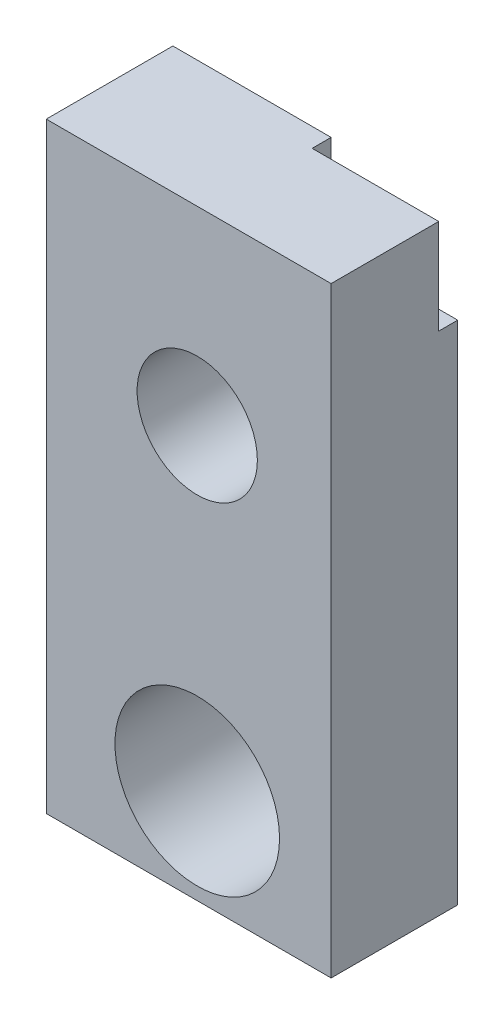
ISO-10303-21;
HEADER;
FILE_DESCRIPTION(('STEP AP214'),'2;1');
FILE_NAME('part.step','',(''),(''),'','','');
FILE_SCHEMA(('AUTOMOTIVE_DESIGN { 1 0 10303 214 1 1 1 1 }'));
ENDSEC;
DATA;
#1=APPLICATION_CONTEXT('core data for automotive mechanical design processes');
#2=APPLICATION_PROTOCOL_DEFINITION('international standard','automotive_design',2000,#1);
#3=PRODUCT_CONTEXT('',#1,'mechanical');
#4=PRODUCT('Part','Part','',(#3));
#5=PRODUCT_RELATED_PRODUCT_CATEGORY('part','',(#4));
#6=PRODUCT_DEFINITION_FORMATION('','',#4);
#7=PRODUCT_DEFINITION_CONTEXT('part definition',#1,'design');
#8=PRODUCT_DEFINITION('design','',#6,#7);
#9=PRODUCT_DEFINITION_SHAPE('','',#8);
#10=(LENGTH_UNIT() NAMED_UNIT(*) SI_UNIT(.MILLI.,.METRE.));
#11=(NAMED_UNIT(*) PLANE_ANGLE_UNIT() SI_UNIT($,.RADIAN.));
#12=(NAMED_UNIT(*) SI_UNIT($,.STERADIAN.) SOLID_ANGLE_UNIT());
#13=UNCERTAINTY_MEASURE_WITH_UNIT(LENGTH_MEASURE(1.E-05),#10,'distance_accuracy_value','');
#14=(GEOMETRIC_REPRESENTATION_CONTEXT(3) GLOBAL_UNCERTAINTY_ASSIGNED_CONTEXT((#13)) GLOBAL_UNIT_ASSIGNED_CONTEXT((#10,
#11,#12)) REPRESENTATION_CONTEXT('',''));
#15=CARTESIAN_POINT('',(0.,0.,0.));
#16=DIRECTION('',(0.,0.,1.));
#17=DIRECTION('',(1.,0.,0.));
#18=AXIS2_PLACEMENT_3D('',#15,#16,#17);
#19=CARTESIAN_POINT('',(0.,0.,20.));
#20=DIRECTION('',(0.,1.,0.));
#21=DIRECTION('',(0.,0.,1.));
#22=AXIS2_PLACEMENT_3D('',#19,#20,#21);
#23=PLANE('',#22);
#24=DIRECTION('',(1.,0.,0.));
#25=VECTOR('',#24,1.);
#26=CARTESIAN_POINT('',(0.,0.,0.));
#27=LINE('',#26,#25);
#28=CARTESIAN_POINT('',(-2.,0.,0.));
#29=VERTEX_POINT('',#28);
#30=CARTESIAN_POINT('',(43.,0.,0.));
#31=VERTEX_POINT('',#30);
#32=EDGE_CURVE('E71',#29,#31,#27,.T.);
#33=ORIENTED_EDGE('',*,*,#32,.T.);
#34=DIRECTION('',(0.,0.,-1.));
#35=VECTOR('',#34,1.);
#36=CARTESIAN_POINT('',(43.,0.,20.));
#37=LINE('',#36,#35);
#38=CARTESIAN_POINT('',(43.,0.,20.));
#39=VERTEX_POINT('',#38);
#40=EDGE_CURVE('E11',#39,#31,#37,.T.);
#41=ORIENTED_EDGE('',*,*,#40,.F.);
#42=DIRECTION('',(1.,0.,0.));
#43=VECTOR('',#42,1.);
#44=CARTESIAN_POINT('',(0.,0.,20.));
#45=LINE('',#44,#43);
#46=CARTESIAN_POINT('',(-2.,0.,20.));
#47=VERTEX_POINT('',#46);
#48=EDGE_CURVE('E122',#47,#39,#45,.T.);
#49=ORIENTED_EDGE('',*,*,#48,.F.);
#50=DIRECTION('',(0.,0.,1.));
#51=VECTOR('',#50,1.);
#52=CARTESIAN_POINT('',(-2.,0.,0.));
#53=LINE('',#52,#51);
#54=EDGE_CURVE('E121',#29,#47,#53,.T.);
#55=ORIENTED_EDGE('',*,*,#54,.F.);
#56=EDGE_LOOP('',(#33,#41,#49,#55));
#57=FACE_BOUND('',#56,.T.);
#58=ADVANCED_FACE('F35',(#57),#23,.F.);
#59=CARTESIAN_POINT('',(43.,0.,20.));
#60=DIRECTION('',(-1.,0.,0.));
#61=DIRECTION('',(0.,-1.,0.));
#62=AXIS2_PLACEMENT_3D('',#59,#60,#61);
#63=PLANE('',#62);
#64=DIRECTION('',(0.,0.,-1.));
#65=VECTOR('',#64,1.);
#66=CARTESIAN_POINT('',(43.,80.,0.));
#67=LINE('',#66,#65);
#68=CARTESIAN_POINT('',(43.,80.,3.));
#69=VERTEX_POINT('',#68);
#70=CARTESIAN_POINT('',(43.,80.,0.));
#71=VERTEX_POINT('',#70);
#72=EDGE_CURVE('E51',#69,#71,#67,.T.);
#73=ORIENTED_EDGE('',*,*,#72,.F.);
#74=DIRECTION('',(0.,1.,0.));
#75=VECTOR('',#74,1.);
#76=CARTESIAN_POINT('',(43.,80.,3.));
#77=LINE('',#76,#75);
#78=CARTESIAN_POINT('',(43.,95.,3.));
#79=VERTEX_POINT('',#78);
#80=EDGE_CURVE('E79',#69,#79,#77,.T.);
#81=ORIENTED_EDGE('',*,*,#80,.T.);
#82=DIRECTION('',(0.,0.,-1.));
#83=VECTOR('',#82,1.);
#84=CARTESIAN_POINT('',(43.,95.,20.));
#85=LINE('',#84,#83);
#86=CARTESIAN_POINT('',(43.,95.,20.));
#87=VERTEX_POINT('',#86);
#88=EDGE_CURVE('E43',#87,#79,#85,.T.);
#89=ORIENTED_EDGE('',*,*,#88,.F.);
#90=DIRECTION('',(0.,1.,0.));
#91=VECTOR('',#90,1.);
#92=CARTESIAN_POINT('',(43.,0.,20.));
#93=LINE('',#92,#91);
#94=EDGE_CURVE('E60',#39,#87,#93,.T.);
#95=ORIENTED_EDGE('',*,*,#94,.F.);
#96=ORIENTED_EDGE('',*,*,#40,.T.);
#97=DIRECTION('',(0.,1.,0.));
#98=VECTOR('',#97,1.);
#99=CARTESIAN_POINT('',(43.,0.,0.));
#100=LINE('',#99,#98);
#101=EDGE_CURVE('E117',#31,#71,#100,.T.);
#102=ORIENTED_EDGE('',*,*,#101,.T.);
#103=EDGE_LOOP('',(#73,#81,#89,#95,#96,#102));
#104=FACE_BOUND('',#103,.T.);
#105=ADVANCED_FACE('F213',(#104),#63,.F.);
#106=CARTESIAN_POINT('',(0.,95.,20.));
#107=DIRECTION('',(0.,-1.,0.));
#108=DIRECTION('',(0.,0.,-1.));
#109=AXIS2_PLACEMENT_3D('',#106,#107,#108);
#110=PLANE('',#109);
#111=ORIENTED_EDGE('',*,*,#88,.T.);
#112=DIRECTION('',(1.,0.,0.));
#113=VECTOR('',#112,1.);
#114=CARTESIAN_POINT('',(43.,95.,3.));
#115=LINE('',#114,#113);
#116=CARTESIAN_POINT('',(23.,95.,3.));
#117=VERTEX_POINT('',#116);
#118=EDGE_CURVE('E93',#117,#79,#115,.T.);
#119=ORIENTED_EDGE('',*,*,#118,.F.);
#120=DIRECTION('',(0.,0.,1.));
#121=VECTOR('',#120,1.);
#122=CARTESIAN_POINT('',(23.,95.,0.));
#123=LINE('',#122,#121);
#124=CARTESIAN_POINT('',(23.,95.,0.));
#125=VERTEX_POINT('',#124);
#126=EDGE_CURVE('E158',#125,#117,#123,.T.);
#127=ORIENTED_EDGE('',*,*,#126,.F.);
#128=DIRECTION('',(-1.,0.,0.));
#129=VECTOR('',#128,1.);
#130=CARTESIAN_POINT('',(0.,95.,0.));
#131=LINE('',#130,#129);
#132=CARTESIAN_POINT('',(-2.00000000000003,95.,0.));
#133=VERTEX_POINT('',#132);
#134=EDGE_CURVE('E182',#125,#133,#131,.T.);
#135=ORIENTED_EDGE('',*,*,#134,.T.);
#136=DIRECTION('',(0.,0.,-1.));
#137=VECTOR('',#136,1.);
#138=CARTESIAN_POINT('',(-2.00000000000003,95.,0.));
#139=LINE('',#138,#137);
#140=CARTESIAN_POINT('',(-2.00000000000003,95.,20.));
#141=VERTEX_POINT('',#140);
#142=EDGE_CURVE('E131',#141,#133,#139,.T.);
#143=ORIENTED_EDGE('',*,*,#142,.F.);
#144=DIRECTION('',(-1.,0.,0.));
#145=VECTOR('',#144,1.);
#146=CARTESIAN_POINT('',(0.,95.,20.));
#147=LINE('',#146,#145);
#148=EDGE_CURVE('E184',#87,#141,#147,.T.);
#149=ORIENTED_EDGE('',*,*,#148,.F.);
#150=EDGE_LOOP('',(#111,#119,#127,#135,#143,#149));
#151=FACE_BOUND('',#150,.T.);
#152=ADVANCED_FACE('F206',(#151),#110,.F.);
#153=CARTESIAN_POINT('',(0.,0.,20.));
#154=DIRECTION('',(0.,0.,-1.));
#155=DIRECTION('',(-1.,0.,0.));
#156=AXIS2_PLACEMENT_3D('',#153,#154,#155);
#157=PLANE('',#156);
#158=CARTESIAN_POINT('',(21.85,65.,20.));
#159=DIRECTION('',(0.,0.,1.));
#160=DIRECTION('',(1.,0.,0.));
#161=AXIS2_PLACEMENT_3D('',#158,#159,#160);
#162=CIRCLE('',#161,9.5);
#163=CARTESIAN_POINT('',(31.35,65.,20.));
#164=VERTEX_POINT('',#163);
#165=EDGE_CURVE('E172',#164,#164,#162,.T.);
#166=ORIENTED_EDGE('',*,*,#165,.F.);
#167=EDGE_LOOP('',(#166));
#168=FACE_BOUND('',#167,.T.);
#169=CARTESIAN_POINT('',(21.85,15.,20.));
#170=DIRECTION('',(0.,0.,1.));
#171=DIRECTION('',(1.,0.,0.));
#172=AXIS2_PLACEMENT_3D('',#169,#170,#171);
#173=CIRCLE('',#172,13.);
#174=CARTESIAN_POINT('',(34.85,15.,20.));
#175=VERTEX_POINT('',#174);
#176=EDGE_CURVE('E178',#175,#175,#173,.T.);
#177=ORIENTED_EDGE('',*,*,#176,.F.);
#178=EDGE_LOOP('',(#177));
#179=FACE_BOUND('',#178,.T.);
#180=ORIENTED_EDGE('',*,*,#148,.T.);
#181=DIRECTION('',(0.,1.,0.));
#182=VECTOR('',#181,1.);
#183=CARTESIAN_POINT('',(-2.,0.,20.));
#184=LINE('',#183,#182);
#185=EDGE_CURVE('E126',#47,#141,#184,.T.);
#186=ORIENTED_EDGE('',*,*,#185,.F.);
#187=ORIENTED_EDGE('',*,*,#48,.T.);
#188=ORIENTED_EDGE('',*,*,#94,.T.);
#189=EDGE_LOOP('',(#180,#186,#187,#188));
#190=FACE_BOUND('',#189,.T.);
#191=ADVANCED_FACE('F196',(#168,#179,#190),#157,.F.);
#192=CARTESIAN_POINT('',(0.,0.,0.));
#193=DIRECTION('',(0.,0.,-1.));
#194=DIRECTION('',(-1.,0.,0.));
#195=AXIS2_PLACEMENT_3D('',#192,#193,#194);
#196=PLANE('',#195);
#197=CARTESIAN_POINT('',(39.35,15.,0.));
#198=DIRECTION('',(0.,0.,-1.));
#199=DIRECTION('',(-1.,0.,0.));
#200=AXIS2_PLACEMENT_3D('',#197,#198,#199);
#201=CIRCLE('',#200,1.5);
#202=CARTESIAN_POINT('',(37.85,15.,0.));
#203=VERTEX_POINT('',#202);
#204=EDGE_CURVE('E136',#203,#203,#201,.T.);
#205=ORIENTED_EDGE('',*,*,#204,.F.);
#206=EDGE_LOOP('',(#205));
#207=FACE_BOUND('',#206,.T.);
#208=CARTESIAN_POINT('',(4.34999999999997,15.,0.));
#209=DIRECTION('',(0.,0.,-1.));
#210=DIRECTION('',(-1.,0.,0.));
#211=AXIS2_PLACEMENT_3D('',#208,#209,#210);
#212=CIRCLE('',#211,1.5);
#213=CARTESIAN_POINT('',(2.84999999999997,15.,0.));
#214=VERTEX_POINT('',#213);
#215=EDGE_CURVE('E140',#214,#214,#212,.T.);
#216=ORIENTED_EDGE('',*,*,#215,.F.);
#217=EDGE_LOOP('',(#216));
#218=FACE_BOUND('',#217,.T.);
#219=DIRECTION('',(0.,1.,0.));
#220=VECTOR('',#219,1.);
#221=CARTESIAN_POINT('',(23.,80.,0.));
#222=LINE('',#221,#220);
#223=CARTESIAN_POINT('',(23.,80.,0.));
#224=VERTEX_POINT('',#223);
#225=EDGE_CURVE('E167',#224,#125,#222,.T.);
#226=ORIENTED_EDGE('',*,*,#225,.F.);
#227=DIRECTION('',(-1.,0.,0.));
#228=VECTOR('',#227,1.);
#229=CARTESIAN_POINT('',(43.,80.,0.));
#230=LINE('',#229,#228);
#231=EDGE_CURVE('E162',#71,#224,#230,.T.);
#232=ORIENTED_EDGE('',*,*,#231,.F.);
#233=ORIENTED_EDGE('',*,*,#101,.F.);
#234=ORIENTED_EDGE('',*,*,#32,.F.);
#235=DIRECTION('',(0.,-1.,0.));
#236=VECTOR('',#235,1.);
#237=CARTESIAN_POINT('',(-2.,0.,0.));
#238=LINE('',#237,#236);
#239=EDGE_CURVE('E115',#133,#29,#238,.T.);
#240=ORIENTED_EDGE('',*,*,#239,.F.);
#241=ORIENTED_EDGE('',*,*,#134,.F.);
#242=EDGE_LOOP('',(#226,#232,#233,#234,#240,#241));
#243=FACE_BOUND('',#242,.T.);
#244=CARTESIAN_POINT('',(21.85,65.,0.));
#245=DIRECTION('',(0.,0.,-1.));
#246=DIRECTION('',(-1.,0.,0.));
#247=AXIS2_PLACEMENT_3D('',#244,#245,#246);
#248=CIRCLE('',#247,9.5);
#249=CARTESIAN_POINT('',(12.35,65.,0.));
#250=VERTEX_POINT('',#249);
#251=EDGE_CURVE('E38',#250,#250,#248,.T.);
#252=ORIENTED_EDGE('',*,*,#251,.F.);
#253=EDGE_LOOP('',(#252));
#254=FACE_BOUND('',#253,.T.);
#255=CARTESIAN_POINT('',(21.85,15.,0.));
#256=DIRECTION('',(0.,0.,-1.));
#257=DIRECTION('',(-1.,0.,0.));
#258=AXIS2_PLACEMENT_3D('',#255,#256,#257);
#259=CIRCLE('',#258,13.);
#260=CARTESIAN_POINT('',(8.85,15.,0.));
#261=VERTEX_POINT('',#260);
#262=EDGE_CURVE('E118',#261,#261,#259,.T.);
#263=ORIENTED_EDGE('',*,*,#262,.F.);
#264=EDGE_LOOP('',(#263));
#265=FACE_BOUND('',#264,.T.);
#266=ADVANCED_FACE('F111',(#207,#218,#243,#254,#265),#196,.T.);
#267=CARTESIAN_POINT('',(21.85,15.,-14.));
#268=DIRECTION('',(0.,0.,1.));
#269=DIRECTION('',(1.,0.,0.));
#270=AXIS2_PLACEMENT_3D('',#267,#268,#269);
#271=CYLINDRICAL_SURFACE('',#270,13.);
#272=ORIENTED_EDGE('',*,*,#262,.T.);
#273=EDGE_LOOP('',(#272));
#274=FACE_BOUND('',#273,.T.);
#275=ORIENTED_EDGE('',*,*,#176,.T.);
#276=EDGE_LOOP('',(#275));
#277=FACE_BOUND('',#276,.T.);
#278=ADVANCED_FACE('F192',(#274,#277),#271,.F.);
#279=CARTESIAN_POINT('',(21.85,65.,-14.));
#280=DIRECTION('',(0.,0.,1.));
#281=DIRECTION('',(1.,0.,0.));
#282=AXIS2_PLACEMENT_3D('',#279,#280,#281);
#283=CYLINDRICAL_SURFACE('',#282,9.5);
#284=ORIENTED_EDGE('',*,*,#251,.T.);
#285=EDGE_LOOP('',(#284));
#286=FACE_BOUND('',#285,.T.);
#287=ORIENTED_EDGE('',*,*,#165,.T.);
#288=EDGE_LOOP('',(#287));
#289=FACE_BOUND('',#288,.T.);
#290=ADVANCED_FACE('F204',(#286,#289),#283,.F.);
#291=CARTESIAN_POINT('',(43.,80.,3.));
#292=DIRECTION('',(0.,0.,1.));
#293=DIRECTION('',(1.,0.,0.));
#294=AXIS2_PLACEMENT_3D('',#291,#292,#293);
#295=PLANE('',#294);
#296=CARTESIAN_POINT('',(28.,86.,3.));
#297=DIRECTION('',(0.,0.,-1.));
#298=DIRECTION('',(-1.,0.,0.));
#299=AXIS2_PLACEMENT_3D('',#296,#297,#298);
#300=CIRCLE('',#299,1.62);
#301=CARTESIAN_POINT('',(26.38,86.,3.));
#302=VERTEX_POINT('',#301);
#303=EDGE_CURVE('E146',#302,#302,#300,.T.);
#304=ORIENTED_EDGE('',*,*,#303,.F.);
#305=EDGE_LOOP('',(#304));
#306=FACE_BOUND('',#305,.T.);
#307=CARTESIAN_POINT('',(38.,86.,3.));
#308=DIRECTION('',(0.,0.,-1.));
#309=DIRECTION('',(-1.,0.,0.));
#310=AXIS2_PLACEMENT_3D('',#307,#308,#309);
#311=CIRCLE('',#310,1.62);
#312=CARTESIAN_POINT('',(36.38,86.,3.));
#313=VERTEX_POINT('',#312);
#314=EDGE_CURVE('E152',#313,#313,#311,.T.);
#315=ORIENTED_EDGE('',*,*,#314,.F.);
#316=EDGE_LOOP('',(#315));
#317=FACE_BOUND('',#316,.T.);
#318=ORIENTED_EDGE('',*,*,#118,.T.);
#319=ORIENTED_EDGE('',*,*,#80,.F.);
#320=DIRECTION('',(1.,0.,0.));
#321=VECTOR('',#320,1.);
#322=CARTESIAN_POINT('',(43.,80.,3.));
#323=LINE('',#322,#321);
#324=CARTESIAN_POINT('',(23.,80.,3.));
#325=VERTEX_POINT('',#324);
#326=EDGE_CURVE('E165',#325,#69,#323,.T.);
#327=ORIENTED_EDGE('',*,*,#326,.F.);
#328=DIRECTION('',(0.,1.,0.));
#329=VECTOR('',#328,1.);
#330=CARTESIAN_POINT('',(23.,80.,3.));
#331=LINE('',#330,#329);
#332=EDGE_CURVE('E173',#325,#117,#331,.T.);
#333=ORIENTED_EDGE('',*,*,#332,.T.);
#334=EDGE_LOOP('',(#318,#319,#327,#333));
#335=FACE_BOUND('',#334,.T.);
#336=ADVANCED_FACE('F227',(#306,#317,#335),#295,.F.);
#337=CARTESIAN_POINT('',(23.,80.,0.));
#338=DIRECTION('',(-1.,0.,0.));
#339=DIRECTION('',(0.,0.,1.));
#340=AXIS2_PLACEMENT_3D('',#337,#338,#339);
#341=PLANE('',#340);
#342=ORIENTED_EDGE('',*,*,#126,.T.);
#343=ORIENTED_EDGE('',*,*,#332,.F.);
#344=DIRECTION('',(0.,0.,1.));
#345=VECTOR('',#344,1.);
#346=CARTESIAN_POINT('',(23.,80.,0.));
#347=LINE('',#346,#345);
#348=EDGE_CURVE('E97',#224,#325,#347,.T.);
#349=ORIENTED_EDGE('',*,*,#348,.F.);
#350=ORIENTED_EDGE('',*,*,#225,.T.);
#351=EDGE_LOOP('',(#342,#343,#349,#350));
#352=FACE_BOUND('',#351,.T.);
#353=ADVANCED_FACE('F225',(#352),#341,.F.);
#354=CARTESIAN_POINT('',(0.,80.,0.));
#355=DIRECTION('',(0.,-1.,0.));
#356=DIRECTION('',(0.,0.,-1.));
#357=AXIS2_PLACEMENT_3D('',#354,#355,#356);
#358=PLANE('',#357);
#359=ORIENTED_EDGE('',*,*,#72,.T.);
#360=ORIENTED_EDGE('',*,*,#231,.T.);
#361=ORIENTED_EDGE('',*,*,#348,.T.);
#362=ORIENTED_EDGE('',*,*,#326,.T.);
#363=EDGE_LOOP('',(#359,#360,#361,#362));
#364=FACE_BOUND('',#363,.T.);
#365=ADVANCED_FACE('F226',(#364),#358,.F.);
#366=CARTESIAN_POINT('',(38.,86.,8.));
#367=DIRECTION('',(0.,0.,-1.));
#368=DIRECTION('',(-1.,0.,0.));
#369=AXIS2_PLACEMENT_3D('',#366,#367,#368);
#370=CYLINDRICAL_SURFACE('',#369,1.62);
#371=CARTESIAN_POINT('',(38.,86.,8.));
#372=DIRECTION('',(0.,0.,-1.));
#373=DIRECTION('',(-1.,0.,0.));
#374=AXIS2_PLACEMENT_3D('',#371,#372,#373);
#375=CIRCLE('',#374,1.62);
#376=CARTESIAN_POINT('',(36.38,86.,8.));
#377=VERTEX_POINT('',#376);
#378=EDGE_CURVE('E155',#377,#377,#375,.T.);
#379=ORIENTED_EDGE('',*,*,#378,.F.);
#380=EDGE_LOOP('',(#379));
#381=FACE_BOUND('',#380,.T.);
#382=ORIENTED_EDGE('',*,*,#314,.T.);
#383=EDGE_LOOP('',(#382));
#384=FACE_BOUND('',#383,.T.);
#385=ADVANCED_FACE('F243',(#381,#384),#370,.F.);
#386=CARTESIAN_POINT('',(38.,86.,8.));
#387=DIRECTION('',(0.,0.,-1.));
#388=DIRECTION('',(-1.,0.,0.));
#389=AXIS2_PLACEMENT_3D('',#386,#387,#388);
#390=PLANE('',#389);
#391=ORIENTED_EDGE('',*,*,#378,.T.);
#392=EDGE_LOOP('',(#391));
#393=FACE_BOUND('',#392,.T.);
#394=ADVANCED_FACE('F246',(#393),#390,.T.);
#395=CARTESIAN_POINT('',(28.,86.,8.));
#396=DIRECTION('',(0.,0.,-1.));
#397=DIRECTION('',(-1.,0.,0.));
#398=AXIS2_PLACEMENT_3D('',#395,#396,#397);
#399=CYLINDRICAL_SURFACE('',#398,1.62);
#400=CARTESIAN_POINT('',(28.,86.,8.));
#401=DIRECTION('',(0.,0.,-1.));
#402=DIRECTION('',(-1.,0.,0.));
#403=AXIS2_PLACEMENT_3D('',#400,#401,#402);
#404=CIRCLE('',#403,1.62);
#405=CARTESIAN_POINT('',(26.38,86.,8.));
#406=VERTEX_POINT('',#405);
#407=EDGE_CURVE('E149',#406,#406,#404,.T.);
#408=ORIENTED_EDGE('',*,*,#407,.F.);
#409=EDGE_LOOP('',(#408));
#410=FACE_BOUND('',#409,.T.);
#411=ORIENTED_EDGE('',*,*,#303,.T.);
#412=EDGE_LOOP('',(#411));
#413=FACE_BOUND('',#412,.T.);
#414=ADVANCED_FACE('F250',(#410,#413),#399,.F.);
#415=CARTESIAN_POINT('',(28.,86.,8.));
#416=DIRECTION('',(0.,0.,-1.));
#417=DIRECTION('',(-1.,0.,0.));
#418=AXIS2_PLACEMENT_3D('',#415,#416,#417);
#419=PLANE('',#418);
#420=ORIENTED_EDGE('',*,*,#407,.T.);
#421=EDGE_LOOP('',(#420));
#422=FACE_BOUND('',#421,.T.);
#423=ADVANCED_FACE('F254',(#422),#419,.T.);
#424=CARTESIAN_POINT('',(4.34999999999997,15.,12.));
#425=DIRECTION('',(0.,0.,-1.));
#426=DIRECTION('',(-1.,0.,0.));
#427=AXIS2_PLACEMENT_3D('',#424,#425,#426);
#428=CYLINDRICAL_SURFACE('',#427,1.5);
#429=CARTESIAN_POINT('',(4.34999999999997,15.,12.));
#430=DIRECTION('',(0.,0.,-1.));
#431=DIRECTION('',(-1.,0.,0.));
#432=AXIS2_PLACEMENT_3D('',#429,#430,#431);
#433=CIRCLE('',#432,1.5);
#434=CARTESIAN_POINT('',(2.84999999999997,15.,12.));
#435=VERTEX_POINT('',#434);
#436=EDGE_CURVE('E143',#435,#435,#433,.T.);
#437=ORIENTED_EDGE('',*,*,#436,.F.);
#438=EDGE_LOOP('',(#437));
#439=FACE_BOUND('',#438,.T.);
#440=ORIENTED_EDGE('',*,*,#215,.T.);
#441=EDGE_LOOP('',(#440));
#442=FACE_BOUND('',#441,.T.);
#443=ADVANCED_FACE('F258',(#439,#442),#428,.F.);
#444=CARTESIAN_POINT('',(4.34999999999997,15.,12.));
#445=DIRECTION('',(0.,0.,-1.));
#446=DIRECTION('',(-1.,0.,0.));
#447=AXIS2_PLACEMENT_3D('',#444,#445,#446);
#448=PLANE('',#447);
#449=ORIENTED_EDGE('',*,*,#436,.T.);
#450=EDGE_LOOP('',(#449));
#451=FACE_BOUND('',#450,.T.);
#452=ADVANCED_FACE('F262',(#451),#448,.T.);
#453=CARTESIAN_POINT('',(39.35,15.,12.));
#454=DIRECTION('',(0.,0.,-1.));
#455=DIRECTION('',(-1.,0.,0.));
#456=AXIS2_PLACEMENT_3D('',#453,#454,#455);
#457=CYLINDRICAL_SURFACE('',#456,1.5);
#458=CARTESIAN_POINT('',(39.35,15.,12.));
#459=DIRECTION('',(0.,0.,-1.));
#460=DIRECTION('',(-1.,0.,0.));
#461=AXIS2_PLACEMENT_3D('',#458,#459,#460);
#462=CIRCLE('',#461,1.5);
#463=CARTESIAN_POINT('',(37.85,15.,12.));
#464=VERTEX_POINT('',#463);
#465=EDGE_CURVE('E137',#464,#464,#462,.T.);
#466=ORIENTED_EDGE('',*,*,#465,.F.);
#467=EDGE_LOOP('',(#466));
#468=FACE_BOUND('',#467,.T.);
#469=ORIENTED_EDGE('',*,*,#204,.T.);
#470=EDGE_LOOP('',(#469));
#471=FACE_BOUND('',#470,.T.);
#472=ADVANCED_FACE('F266',(#468,#471),#457,.F.);
#473=CARTESIAN_POINT('',(39.35,15.,12.));
#474=DIRECTION('',(0.,0.,-1.));
#475=DIRECTION('',(-1.,0.,0.));
#476=AXIS2_PLACEMENT_3D('',#473,#474,#475);
#477=PLANE('',#476);
#478=ORIENTED_EDGE('',*,*,#465,.T.);
#479=EDGE_LOOP('',(#478));
#480=FACE_BOUND('',#479,.T.);
#481=ADVANCED_FACE('F270',(#480),#477,.T.);
#482=CARTESIAN_POINT('',(-2.,0.,0.));
#483=DIRECTION('',(1.,0.,0.));
#484=DIRECTION('',(0.,1.,0.));
#485=AXIS2_PLACEMENT_3D('',#482,#483,#484);
#486=PLANE('',#485);
#487=ORIENTED_EDGE('',*,*,#239,.T.);
#488=ORIENTED_EDGE('',*,*,#54,.T.);
#489=ORIENTED_EDGE('',*,*,#185,.T.);
#490=ORIENTED_EDGE('',*,*,#142,.T.);
#491=EDGE_LOOP('',(#487,#488,#489,#490));
#492=FACE_BOUND('',#491,.T.);
#493=ADVANCED_FACE('F129',(#492),#486,.F.);
#494=CLOSED_SHELL('',(#58,#105,#152,#191,#266,#278,#290,#336,#353,#365,#385,#394,#414,#423,#443,
#452,#472,#481,#493));
#495=MANIFOLD_SOLID_BREP('B2',#494);
#496=ADVANCED_BREP_SHAPE_REPRESENTATION('',(#18,#495),#14);
#497=SHAPE_DEFINITION_REPRESENTATION(#9,#496);
ENDSEC;
END-ISO-10303-21;
